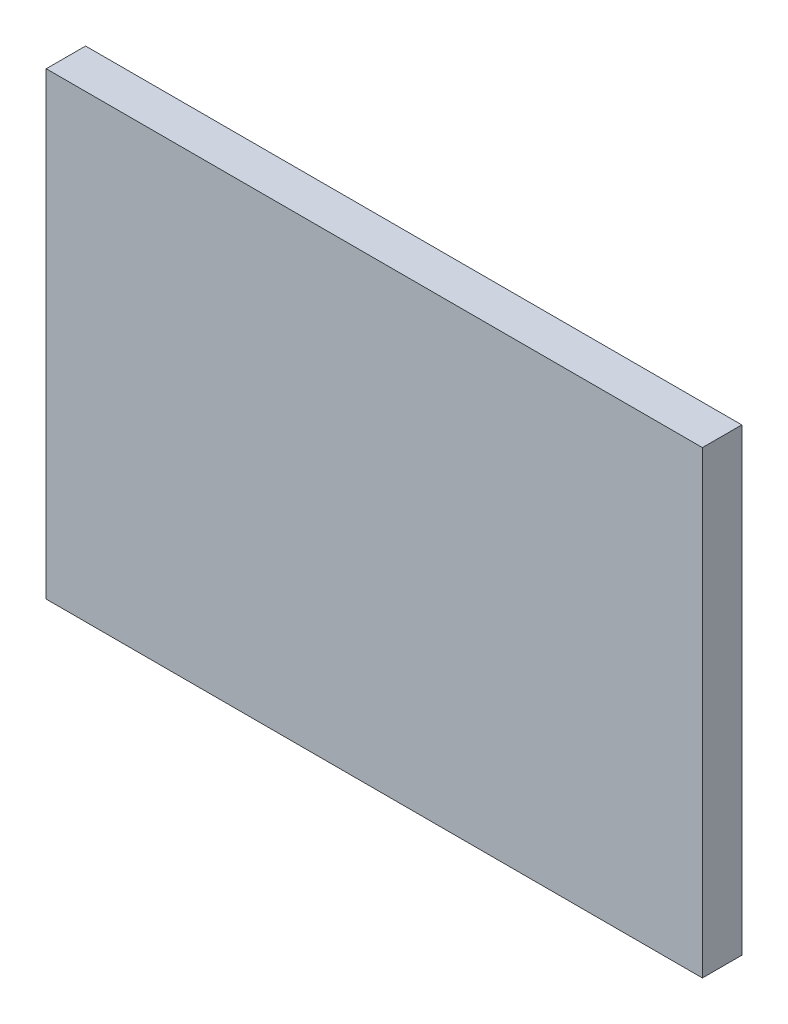
ISO-10303-21;
HEADER;
FILE_DESCRIPTION(('STEP AP214'),'2;1');
FILE_NAME('part.step','',(''),(''),'','','');
FILE_SCHEMA(('AUTOMOTIVE_DESIGN { 1 0 10303 214 1 1 1 1 }'));
ENDSEC;
DATA;
#1=APPLICATION_CONTEXT('core data for automotive mechanical design processes');
#2=APPLICATION_PROTOCOL_DEFINITION('international standard','automotive_design',2000,#1);
#3=PRODUCT_CONTEXT('',#1,'mechanical');
#4=PRODUCT('Part','Part','',(#3));
#5=PRODUCT_RELATED_PRODUCT_CATEGORY('part','',(#4));
#6=PRODUCT_DEFINITION_FORMATION('','',#4);
#7=PRODUCT_DEFINITION_CONTEXT('part definition',#1,'design');
#8=PRODUCT_DEFINITION('design','',#6,#7);
#9=PRODUCT_DEFINITION_SHAPE('','',#8);
#10=(LENGTH_UNIT() NAMED_UNIT(*) SI_UNIT(.MILLI.,.METRE.));
#11=(NAMED_UNIT(*) PLANE_ANGLE_UNIT() SI_UNIT($,.RADIAN.));
#12=(NAMED_UNIT(*) SI_UNIT($,.STERADIAN.) SOLID_ANGLE_UNIT());
#13=UNCERTAINTY_MEASURE_WITH_UNIT(LENGTH_MEASURE(1.E-05),#10,'distance_accuracy_value','');
#14=(GEOMETRIC_REPRESENTATION_CONTEXT(3) GLOBAL_UNCERTAINTY_ASSIGNED_CONTEXT((#13)) GLOBAL_UNIT_ASSIGNED_CONTEXT((#10,
#11,#12)) REPRESENTATION_CONTEXT('',''));
#15=CARTESIAN_POINT('',(0.,0.,0.));
#16=DIRECTION('',(0.,0.,1.));
#17=DIRECTION('',(1.,0.,0.));
#18=AXIS2_PLACEMENT_3D('',#15,#16,#17);
#19=CARTESIAN_POINT('',(25.,17.5,3.));
#20=DIRECTION('',(-1.,0.,0.));
#21=DIRECTION('',(0.,-1.,0.));
#22=AXIS2_PLACEMENT_3D('',#19,#20,#21);
#23=PLANE('',#22);
#24=DIRECTION('',(0.,1.,0.));
#25=VECTOR('',#24,1.);
#26=CARTESIAN_POINT('',(25.,17.5,0.));
#27=LINE('',#26,#25);
#28=CARTESIAN_POINT('',(25.,-17.5,0.));
#29=VERTEX_POINT('',#28);
#30=CARTESIAN_POINT('',(25.,17.5,0.));
#31=VERTEX_POINT('',#30);
#32=EDGE_CURVE('E100',#29,#31,#27,.T.);
#33=ORIENTED_EDGE('',*,*,#32,.T.);
#34=DIRECTION('',(0.,0.,-1.));
#35=VECTOR('',#34,1.);
#36=CARTESIAN_POINT('',(25.,17.5,3.));
#37=LINE('',#36,#35);
#38=CARTESIAN_POINT('',(25.,17.5,3.));
#39=VERTEX_POINT('',#38);
#40=EDGE_CURVE('E11',#39,#31,#37,.T.);
#41=ORIENTED_EDGE('',*,*,#40,.F.);
#42=DIRECTION('',(0.,1.,0.));
#43=VECTOR('',#42,1.);
#44=CARTESIAN_POINT('',(25.,17.5,3.));
#45=LINE('',#44,#43);
#46=CARTESIAN_POINT('',(25.,-17.5,3.));
#47=VERTEX_POINT('',#46);
#48=EDGE_CURVE('E88',#47,#39,#45,.T.);
#49=ORIENTED_EDGE('',*,*,#48,.F.);
#50=DIRECTION('',(0.,0.,-1.));
#51=VECTOR('',#50,1.);
#52=CARTESIAN_POINT('',(25.,-17.5,3.));
#53=LINE('',#52,#51);
#54=EDGE_CURVE('E96',#47,#29,#53,.T.);
#55=ORIENTED_EDGE('',*,*,#54,.T.);
#56=EDGE_LOOP('',(#33,#41,#49,#55));
#57=FACE_BOUND('',#56,.T.);
#58=ADVANCED_FACE('F37',(#57),#23,.F.);
#59=CARTESIAN_POINT('',(-25.,17.5,3.));
#60=DIRECTION('',(0.,-1.,0.));
#61=DIRECTION('',(0.,0.,-1.));
#62=AXIS2_PLACEMENT_3D('',#59,#60,#61);
#63=PLANE('',#62);
#64=DIRECTION('',(-1.,0.,0.));
#65=VECTOR('',#64,1.);
#66=CARTESIAN_POINT('',(-25.,17.5,0.));
#67=LINE('',#66,#65);
#68=CARTESIAN_POINT('',(-25.,17.5,0.));
#69=VERTEX_POINT('',#68);
#70=EDGE_CURVE('E92',#31,#69,#67,.T.);
#71=ORIENTED_EDGE('',*,*,#70,.T.);
#72=DIRECTION('',(0.,0.,-1.));
#73=VECTOR('',#72,1.);
#74=CARTESIAN_POINT('',(-25.,17.5,3.));
#75=LINE('',#74,#73);
#76=CARTESIAN_POINT('',(-25.,17.5,3.));
#77=VERTEX_POINT('',#76);
#78=EDGE_CURVE('E45',#77,#69,#75,.T.);
#79=ORIENTED_EDGE('',*,*,#78,.F.);
#80=DIRECTION('',(-1.,0.,0.));
#81=VECTOR('',#80,1.);
#82=CARTESIAN_POINT('',(-25.,17.5,3.));
#83=LINE('',#82,#81);
#84=EDGE_CURVE('E83',#39,#77,#83,.T.);
#85=ORIENTED_EDGE('',*,*,#84,.F.);
#86=ORIENTED_EDGE('',*,*,#40,.T.);
#87=EDGE_LOOP('',(#71,#79,#85,#86));
#88=FACE_BOUND('',#87,.T.);
#89=ADVANCED_FACE('F91',(#88),#63,.F.);
#90=CARTESIAN_POINT('',(-25.,17.5,3.));
#91=DIRECTION('',(1.,0.,0.));
#92=DIRECTION('',(0.,1.,0.));
#93=AXIS2_PLACEMENT_3D('',#90,#91,#92);
#94=PLANE('',#93);
#95=DIRECTION('',(0.,-1.,0.));
#96=VECTOR('',#95,1.);
#97=CARTESIAN_POINT('',(-25.,17.5,0.));
#98=LINE('',#97,#96);
#99=CARTESIAN_POINT('',(-25.,-17.5,0.));
#100=VERTEX_POINT('',#99);
#101=EDGE_CURVE('E70',#69,#100,#98,.T.);
#102=ORIENTED_EDGE('',*,*,#101,.T.);
#103=DIRECTION('',(0.,0.,-1.));
#104=VECTOR('',#103,1.);
#105=CARTESIAN_POINT('',(-25.,-17.5,3.));
#106=LINE('',#105,#104);
#107=CARTESIAN_POINT('',(-25.,-17.5,3.));
#108=VERTEX_POINT('',#107);
#109=EDGE_CURVE('E93',#108,#100,#106,.T.);
#110=ORIENTED_EDGE('',*,*,#109,.F.);
#111=DIRECTION('',(0.,-1.,0.));
#112=VECTOR('',#111,1.);
#113=CARTESIAN_POINT('',(-25.,17.5,3.));
#114=LINE('',#113,#112);
#115=EDGE_CURVE('E86',#77,#108,#114,.T.);
#116=ORIENTED_EDGE('',*,*,#115,.F.);
#117=ORIENTED_EDGE('',*,*,#78,.T.);
#118=EDGE_LOOP('',(#102,#110,#116,#117));
#119=FACE_BOUND('',#118,.T.);
#120=ADVANCED_FACE('F94',(#119),#94,.F.);
#121=CARTESIAN_POINT('',(-25.,-17.5,3.));
#122=DIRECTION('',(0.,1.,0.));
#123=DIRECTION('',(0.,0.,1.));
#124=AXIS2_PLACEMENT_3D('',#121,#122,#123);
#125=PLANE('',#124);
#126=DIRECTION('',(1.,0.,0.));
#127=VECTOR('',#126,1.);
#128=CARTESIAN_POINT('',(-25.,-17.5,0.));
#129=LINE('',#128,#127);
#130=EDGE_CURVE('E76',#100,#29,#129,.T.);
#131=ORIENTED_EDGE('',*,*,#130,.T.);
#132=ORIENTED_EDGE('',*,*,#54,.F.);
#133=DIRECTION('',(1.,0.,0.));
#134=VECTOR('',#133,1.);
#135=CARTESIAN_POINT('',(-25.,-17.5,3.));
#136=LINE('',#135,#134);
#137=EDGE_CURVE('E53',#108,#47,#136,.T.);
#138=ORIENTED_EDGE('',*,*,#137,.F.);
#139=ORIENTED_EDGE('',*,*,#109,.T.);
#140=EDGE_LOOP('',(#131,#132,#138,#139));
#141=FACE_BOUND('',#140,.T.);
#142=ADVANCED_FACE('F107',(#141),#125,.F.);
#143=CARTESIAN_POINT('',(0.,0.,3.));
#144=DIRECTION('',(0.,0.,1.));
#145=DIRECTION('',(1.,0.,0.));
#146=AXIS2_PLACEMENT_3D('',#143,#144,#145);
#147=PLANE('',#146);
#148=ORIENTED_EDGE('',*,*,#48,.T.);
#149=ORIENTED_EDGE('',*,*,#84,.T.);
#150=ORIENTED_EDGE('',*,*,#115,.T.);
#151=ORIENTED_EDGE('',*,*,#137,.T.);
#152=EDGE_LOOP('',(#148,#149,#150,#151));
#153=FACE_BOUND('',#152,.T.);
#154=ADVANCED_FACE('F84',(#153),#147,.T.);
#155=CARTESIAN_POINT('',(0.,0.,0.));
#156=DIRECTION('',(0.,0.,1.));
#157=DIRECTION('',(1.,0.,0.));
#158=AXIS2_PLACEMENT_3D('',#155,#156,#157);
#159=PLANE('',#158);
#160=ORIENTED_EDGE('',*,*,#32,.F.);
#161=ORIENTED_EDGE('',*,*,#130,.F.);
#162=ORIENTED_EDGE('',*,*,#101,.F.);
#163=ORIENTED_EDGE('',*,*,#70,.F.);
#164=EDGE_LOOP('',(#160,#161,#162,#163));
#165=FACE_BOUND('',#164,.T.);
#166=ADVANCED_FACE('F110',(#165),#159,.F.);
#167=CLOSED_SHELL('',(#58,#89,#120,#142,#154,#166));
#168=MANIFOLD_SOLID_BREP('B2',#167);
#169=ADVANCED_BREP_SHAPE_REPRESENTATION('',(#18,#168),#14);
#170=SHAPE_DEFINITION_REPRESENTATION(#9,#169);
ENDSEC;
END-ISO-10303-21;
